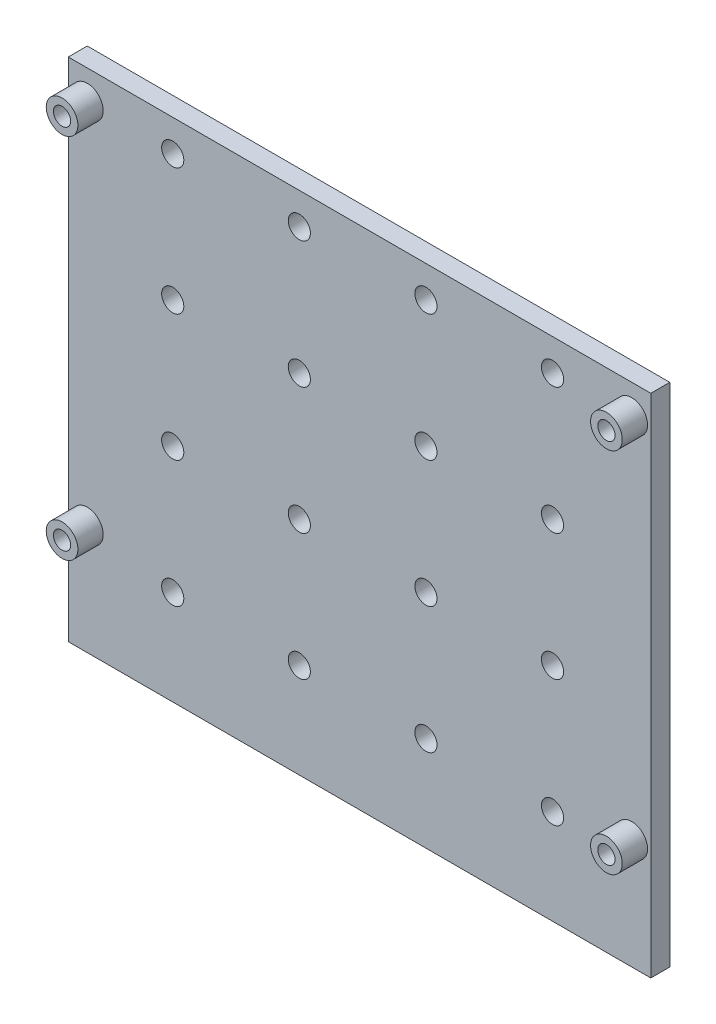
ISO-10303-21;
HEADER;
FILE_DESCRIPTION(('STEP AP214'),'2;1');
FILE_NAME('part.step','',(''),(''),'','','');
FILE_SCHEMA(('AUTOMOTIVE_DESIGN { 1 0 10303 214 1 1 1 1 }'));
ENDSEC;
DATA;
#1=APPLICATION_CONTEXT('core data for automotive mechanical design processes');
#2=APPLICATION_PROTOCOL_DEFINITION('international standard','automotive_design',2000,#1);
#3=PRODUCT_CONTEXT('',#1,'mechanical');
#4=PRODUCT('Part','Part','',(#3));
#5=PRODUCT_RELATED_PRODUCT_CATEGORY('part','',(#4));
#6=PRODUCT_DEFINITION_FORMATION('','',#4);
#7=PRODUCT_DEFINITION_CONTEXT('part definition',#1,'design');
#8=PRODUCT_DEFINITION('design','',#6,#7);
#9=PRODUCT_DEFINITION_SHAPE('','',#8);
#10=(LENGTH_UNIT() NAMED_UNIT(*) SI_UNIT(.MILLI.,.METRE.));
#11=(NAMED_UNIT(*) PLANE_ANGLE_UNIT() SI_UNIT($,.RADIAN.));
#12=(NAMED_UNIT(*) SI_UNIT($,.STERADIAN.) SOLID_ANGLE_UNIT());
#13=UNCERTAINTY_MEASURE_WITH_UNIT(LENGTH_MEASURE(1.E-05),#10,'distance_accuracy_value','');
#14=(GEOMETRIC_REPRESENTATION_CONTEXT(3) GLOBAL_UNCERTAINTY_ASSIGNED_CONTEXT((#13)) GLOBAL_UNIT_ASSIGNED_CONTEXT((#10,
#11,#12)) REPRESENTATION_CONTEXT('',''));
#15=CARTESIAN_POINT('',(0.,0.,0.));
#16=DIRECTION('',(0.,0.,1.));
#17=DIRECTION('',(1.,0.,0.));
#18=AXIS2_PLACEMENT_3D('',#15,#16,#17);
#19=CARTESIAN_POINT('',(0.,0.,3.));
#20=DIRECTION('',(0.,0.,-1.));
#21=DIRECTION('',(-1.,0.,0.));
#22=AXIS2_PLACEMENT_3D('',#19,#20,#21);
#23=PLANE('',#22);
#24=CARTESIAN_POINT('',(30.4875186568319,-25.,3.));
#25=DIRECTION('',(0.,0.,-1.));
#26=DIRECTION('',(-1.,0.,0.));
#27=AXIS2_PLACEMENT_3D('',#24,#25,#26);
#28=CIRCLE('',#27,1.75);
#29=CARTESIAN_POINT('',(28.7375186568319,-25.,3.));
#30=VERTEX_POINT('',#29);
#31=EDGE_CURVE('E380',#30,#30,#28,.T.);
#32=ORIENTED_EDGE('',*,*,#31,.T.);
#33=EDGE_LOOP('',(#32));
#34=FACE_BOUND('',#33,.T.);
#35=CARTESIAN_POINT('',(10.4875186568319,-25.,3.));
#36=DIRECTION('',(0.,0.,-1.));
#37=DIRECTION('',(-1.,0.,0.));
#38=AXIS2_PLACEMENT_3D('',#35,#36,#37);
#39=CIRCLE('',#38,1.75);
#40=CARTESIAN_POINT('',(8.73751865683187,-25.,3.));
#41=VERTEX_POINT('',#40);
#42=EDGE_CURVE('E372',#41,#41,#39,.T.);
#43=ORIENTED_EDGE('',*,*,#42,.T.);
#44=EDGE_LOOP('',(#43));
#45=FACE_BOUND('',#44,.T.);
#46=CARTESIAN_POINT('',(-9.51248134316813,-25.,3.));
#47=DIRECTION('',(0.,0.,-1.));
#48=DIRECTION('',(-1.,0.,0.));
#49=AXIS2_PLACEMENT_3D('',#46,#47,#48);
#50=CIRCLE('',#49,1.75);
#51=CARTESIAN_POINT('',(-11.2624813431681,-25.,3.));
#52=VERTEX_POINT('',#51);
#53=EDGE_CURVE('E364',#52,#52,#50,.T.);
#54=ORIENTED_EDGE('',*,*,#53,.T.);
#55=EDGE_LOOP('',(#54));
#56=FACE_BOUND('',#55,.T.);
#57=CARTESIAN_POINT('',(-29.5124813431681,-25.,3.));
#58=DIRECTION('',(0.,0.,-1.));
#59=DIRECTION('',(-1.,0.,0.));
#60=AXIS2_PLACEMENT_3D('',#57,#58,#59);
#61=CIRCLE('',#60,1.75);
#62=CARTESIAN_POINT('',(-31.2624813431681,-25.,3.));
#63=VERTEX_POINT('',#62);
#64=EDGE_CURVE('E356',#63,#63,#61,.T.);
#65=ORIENTED_EDGE('',*,*,#64,.T.);
#66=EDGE_LOOP('',(#65));
#67=FACE_BOUND('',#66,.T.);
#68=CARTESIAN_POINT('',(30.4875186568319,-5.,3.));
#69=DIRECTION('',(0.,0.,-1.));
#70=DIRECTION('',(-1.,0.,0.));
#71=AXIS2_PLACEMENT_3D('',#68,#69,#70);
#72=CIRCLE('',#71,1.75);
#73=CARTESIAN_POINT('',(28.7375186568319,-5.,3.));
#74=VERTEX_POINT('',#73);
#75=EDGE_CURVE('E348',#74,#74,#72,.T.);
#76=ORIENTED_EDGE('',*,*,#75,.T.);
#77=EDGE_LOOP('',(#76));
#78=FACE_BOUND('',#77,.T.);
#79=CARTESIAN_POINT('',(10.4875186568319,-5.,3.));
#80=DIRECTION('',(0.,0.,-1.));
#81=DIRECTION('',(-1.,0.,0.));
#82=AXIS2_PLACEMENT_3D('',#79,#80,#81);
#83=CIRCLE('',#82,1.75);
#84=CARTESIAN_POINT('',(8.73751865683187,-5.,3.));
#85=VERTEX_POINT('',#84);
#86=EDGE_CURVE('E340',#85,#85,#83,.T.);
#87=ORIENTED_EDGE('',*,*,#86,.T.);
#88=EDGE_LOOP('',(#87));
#89=FACE_BOUND('',#88,.T.);
#90=CARTESIAN_POINT('',(-9.51248134316813,-5.,3.));
#91=DIRECTION('',(0.,0.,-1.));
#92=DIRECTION('',(-1.,0.,0.));
#93=AXIS2_PLACEMENT_3D('',#90,#91,#92);
#94=CIRCLE('',#93,1.75);
#95=CARTESIAN_POINT('',(-11.2624813431681,-5.,3.));
#96=VERTEX_POINT('',#95);
#97=EDGE_CURVE('E332',#96,#96,#94,.T.);
#98=ORIENTED_EDGE('',*,*,#97,.T.);
#99=EDGE_LOOP('',(#98));
#100=FACE_BOUND('',#99,.T.);
#101=CARTESIAN_POINT('',(-29.5124813431681,-5.,3.));
#102=DIRECTION('',(0.,0.,-1.));
#103=DIRECTION('',(-1.,0.,0.));
#104=AXIS2_PLACEMENT_3D('',#101,#102,#103);
#105=CIRCLE('',#104,1.75);
#106=CARTESIAN_POINT('',(-31.2624813431681,-5.,3.));
#107=VERTEX_POINT('',#106);
#108=EDGE_CURVE('E324',#107,#107,#105,.T.);
#109=ORIENTED_EDGE('',*,*,#108,.T.);
#110=EDGE_LOOP('',(#109));
#111=FACE_BOUND('',#110,.T.);
#112=CARTESIAN_POINT('',(30.4875186568319,15.,3.));
#113=DIRECTION('',(0.,0.,-1.));
#114=DIRECTION('',(-1.,0.,0.));
#115=AXIS2_PLACEMENT_3D('',#112,#113,#114);
#116=CIRCLE('',#115,1.75);
#117=CARTESIAN_POINT('',(28.7375186568319,15.,3.));
#118=VERTEX_POINT('',#117);
#119=EDGE_CURVE('E316',#118,#118,#116,.T.);
#120=ORIENTED_EDGE('',*,*,#119,.T.);
#121=EDGE_LOOP('',(#120));
#122=FACE_BOUND('',#121,.T.);
#123=CARTESIAN_POINT('',(10.4875186568319,15.,3.));
#124=DIRECTION('',(0.,0.,-1.));
#125=DIRECTION('',(-1.,0.,0.));
#126=AXIS2_PLACEMENT_3D('',#123,#124,#125);
#127=CIRCLE('',#126,1.75);
#128=CARTESIAN_POINT('',(8.73751865683187,15.,3.));
#129=VERTEX_POINT('',#128);
#130=EDGE_CURVE('E308',#129,#129,#127,.T.);
#131=ORIENTED_EDGE('',*,*,#130,.T.);
#132=EDGE_LOOP('',(#131));
#133=FACE_BOUND('',#132,.T.);
#134=CARTESIAN_POINT('',(-9.51248134316813,15.,3.));
#135=DIRECTION('',(0.,0.,-1.));
#136=DIRECTION('',(-1.,0.,0.));
#137=AXIS2_PLACEMENT_3D('',#134,#135,#136);
#138=CIRCLE('',#137,1.75);
#139=CARTESIAN_POINT('',(-11.2624813431681,15.,3.));
#140=VERTEX_POINT('',#139);
#141=EDGE_CURVE('E300',#140,#140,#138,.T.);
#142=ORIENTED_EDGE('',*,*,#141,.T.);
#143=EDGE_LOOP('',(#142));
#144=FACE_BOUND('',#143,.T.);
#145=CARTESIAN_POINT('',(-29.5124813431681,15.,3.));
#146=DIRECTION('',(0.,0.,-1.));
#147=DIRECTION('',(-1.,0.,0.));
#148=AXIS2_PLACEMENT_3D('',#145,#146,#147);
#149=CIRCLE('',#148,1.75);
#150=CARTESIAN_POINT('',(-31.2624813431681,15.,3.));
#151=VERTEX_POINT('',#150);
#152=EDGE_CURVE('E292',#151,#151,#149,.T.);
#153=ORIENTED_EDGE('',*,*,#152,.T.);
#154=EDGE_LOOP('',(#153));
#155=FACE_BOUND('',#154,.T.);
#156=CARTESIAN_POINT('',(30.4875186568319,35.,3.));
#157=DIRECTION('',(0.,0.,-1.));
#158=DIRECTION('',(-1.,0.,0.));
#159=AXIS2_PLACEMENT_3D('',#156,#157,#158);
#160=CIRCLE('',#159,1.75);
#161=CARTESIAN_POINT('',(28.7375186568319,35.,3.));
#162=VERTEX_POINT('',#161);
#163=EDGE_CURVE('E284',#162,#162,#160,.T.);
#164=ORIENTED_EDGE('',*,*,#163,.T.);
#165=EDGE_LOOP('',(#164));
#166=FACE_BOUND('',#165,.T.);
#167=CARTESIAN_POINT('',(10.4875186568319,35.,3.));
#168=DIRECTION('',(0.,0.,-1.));
#169=DIRECTION('',(-1.,0.,0.));
#170=AXIS2_PLACEMENT_3D('',#167,#168,#169);
#171=CIRCLE('',#170,1.75);
#172=CARTESIAN_POINT('',(8.73751865683187,35.,3.));
#173=VERTEX_POINT('',#172);
#174=EDGE_CURVE('E276',#173,#173,#171,.T.);
#175=ORIENTED_EDGE('',*,*,#174,.T.);
#176=EDGE_LOOP('',(#175));
#177=FACE_BOUND('',#176,.T.);
#178=CARTESIAN_POINT('',(-9.51248134316813,35.,3.));
#179=DIRECTION('',(0.,0.,-1.));
#180=DIRECTION('',(-1.,0.,0.));
#181=AXIS2_PLACEMENT_3D('',#178,#179,#180);
#182=CIRCLE('',#181,1.75);
#183=CARTESIAN_POINT('',(-11.2624813431681,35.,3.));
#184=VERTEX_POINT('',#183);
#185=EDGE_CURVE('E268',#184,#184,#182,.T.);
#186=ORIENTED_EDGE('',*,*,#185,.T.);
#187=EDGE_LOOP('',(#186));
#188=FACE_BOUND('',#187,.T.);
#189=CARTESIAN_POINT('',(-29.5124813431681,35.,3.));
#190=DIRECTION('',(0.,0.,-1.));
#191=DIRECTION('',(-1.,0.,0.));
#192=AXIS2_PLACEMENT_3D('',#189,#190,#191);
#193=CIRCLE('',#192,1.75);
#194=CARTESIAN_POINT('',(-31.2624813431681,35.,3.));
#195=VERTEX_POINT('',#194);
#196=EDGE_CURVE('E260',#195,#195,#193,.T.);
#197=ORIENTED_EDGE('',*,*,#196,.T.);
#198=EDGE_LOOP('',(#197));
#199=FACE_BOUND('',#198,.T.);
#200=CARTESIAN_POINT('',(43.0024813431681,35.4,3.));
#201=DIRECTION('',(0.,0.,-1.));
#202=DIRECTION('',(-1.,0.,0.));
#203=AXIS2_PLACEMENT_3D('',#200,#201,#202);
#204=CIRCLE('',#203,2.5);
#205=CARTESIAN_POINT('',(40.5024813431681,35.4,3.));
#206=VERTEX_POINT('',#205);
#207=EDGE_CURVE('E53',#206,#206,#204,.F.);
#208=ORIENTED_EDGE('',*,*,#207,.F.);
#209=EDGE_LOOP('',(#208));
#210=FACE_BOUND('',#209,.T.);
#211=CARTESIAN_POINT('',(-42.9975186568319,35.4,3.));
#212=DIRECTION('',(0.,0.,-1.));
#213=DIRECTION('',(-1.,0.,0.));
#214=AXIS2_PLACEMENT_3D('',#211,#212,#213);
#215=CIRCLE('',#214,2.5);
#216=CARTESIAN_POINT('',(-45.4975186568319,35.4,3.));
#217=VERTEX_POINT('',#216);
#218=EDGE_CURVE('E133',#217,#217,#215,.F.);
#219=ORIENTED_EDGE('',*,*,#218,.F.);
#220=EDGE_LOOP('',(#219));
#221=FACE_BOUND('',#220,.T.);
#222=DIRECTION('',(0.,1.,0.));
#223=VECTOR('',#222,1.);
#224=CARTESIAN_POINT('',(46.0124813431681,-40.,3.));
#225=LINE('',#224,#223);
#226=CARTESIAN_POINT('',(46.0124813431681,-40.,3.));
#227=VERTEX_POINT('',#226);
#228=CARTESIAN_POINT('',(46.0124813431681,40.,3.));
#229=VERTEX_POINT('',#228);
#230=EDGE_CURVE('E97',#227,#229,#225,.T.);
#231=ORIENTED_EDGE('',*,*,#230,.T.);
#232=DIRECTION('',(-1.,0.,0.));
#233=VECTOR('',#232,1.);
#234=CARTESIAN_POINT('',(-46.0124813431681,40.,3.));
#235=LINE('',#234,#233);
#236=CARTESIAN_POINT('',(-46.0124813431681,40.,3.));
#237=VERTEX_POINT('',#236);
#238=EDGE_CURVE('E92',#229,#237,#235,.T.);
#239=ORIENTED_EDGE('',*,*,#238,.T.);
#240=DIRECTION('',(0.,-1.,0.));
#241=VECTOR('',#240,1.);
#242=CARTESIAN_POINT('',(-46.0124813431681,-40.,3.));
#243=LINE('',#242,#241);
#244=CARTESIAN_POINT('',(-46.0124813431681,-40.,3.));
#245=VERTEX_POINT('',#244);
#246=EDGE_CURVE('E95',#237,#245,#243,.T.);
#247=ORIENTED_EDGE('',*,*,#246,.T.);
#248=DIRECTION('',(1.,0.,0.));
#249=VECTOR('',#248,1.);
#250=CARTESIAN_POINT('',(-46.0124813431681,-40.,3.));
#251=LINE('',#250,#249);
#252=EDGE_CURVE('E61',#245,#227,#251,.T.);
#253=ORIENTED_EDGE('',*,*,#252,.T.);
#254=EDGE_LOOP('',(#231,#239,#247,#253));
#255=FACE_BOUND('',#254,.T.);
#256=CARTESIAN_POINT('',(-42.9975186568319,-22.6,3.));
#257=DIRECTION('',(0.,0.,-1.));
#258=DIRECTION('',(-1.,0.,0.));
#259=AXIS2_PLACEMENT_3D('',#256,#257,#258);
#260=CIRCLE('',#259,2.5);
#261=CARTESIAN_POINT('',(-45.4975186568319,-22.6,3.));
#262=VERTEX_POINT('',#261);
#263=EDGE_CURVE('E137',#262,#262,#260,.F.);
#264=ORIENTED_EDGE('',*,*,#263,.F.);
#265=EDGE_LOOP('',(#264));
#266=FACE_BOUND('',#265,.T.);
#267=CARTESIAN_POINT('',(43.0024813431681,-22.6,3.));
#268=DIRECTION('',(0.,0.,-1.));
#269=DIRECTION('',(-1.,0.,0.));
#270=AXIS2_PLACEMENT_3D('',#267,#268,#269);
#271=CIRCLE('',#270,2.5);
#272=CARTESIAN_POINT('',(40.5024813431681,-22.6,3.));
#273=VERTEX_POINT('',#272);
#274=EDGE_CURVE('E11',#273,#273,#271,.F.);
#275=ORIENTED_EDGE('',*,*,#274,.F.);
#276=EDGE_LOOP('',(#275));
#277=FACE_BOUND('',#276,.T.);
#278=ADVANCED_FACE('F43',(#34,#45,#56,#67,#78,#89,#100,#111,#122,#133,#144,#155,#166,#177,#188,
#199,#210,#221,#255,#266,#277),#23,.F.);
#279=CARTESIAN_POINT('',(0.,0.,0.));
#280=DIRECTION('',(0.,0.,-1.));
#281=DIRECTION('',(-1.,0.,0.));
#282=AXIS2_PLACEMENT_3D('',#279,#280,#281);
#283=PLANE('',#282);
#284=CARTESIAN_POINT('',(30.4875186568319,-25.,0.));
#285=DIRECTION('',(0.,0.,1.));
#286=DIRECTION('',(1.,0.,0.));
#287=AXIS2_PLACEMENT_3D('',#284,#285,#286);
#288=CIRCLE('',#287,1.75);
#289=CARTESIAN_POINT('',(32.2375186568319,-25.,0.));
#290=VERTEX_POINT('',#289);
#291=EDGE_CURVE('E384',#290,#290,#288,.T.);
#292=ORIENTED_EDGE('',*,*,#291,.T.);
#293=EDGE_LOOP('',(#292));
#294=FACE_BOUND('',#293,.T.);
#295=CARTESIAN_POINT('',(10.4875186568319,-25.,0.));
#296=DIRECTION('',(0.,0.,1.));
#297=DIRECTION('',(1.,0.,0.));
#298=AXIS2_PLACEMENT_3D('',#295,#296,#297);
#299=CIRCLE('',#298,1.75);
#300=CARTESIAN_POINT('',(12.2375186568319,-25.,0.));
#301=VERTEX_POINT('',#300);
#302=EDGE_CURVE('E376',#301,#301,#299,.T.);
#303=ORIENTED_EDGE('',*,*,#302,.T.);
#304=EDGE_LOOP('',(#303));
#305=FACE_BOUND('',#304,.T.);
#306=CARTESIAN_POINT('',(-9.51248134316813,-25.,0.));
#307=DIRECTION('',(0.,0.,1.));
#308=DIRECTION('',(1.,0.,0.));
#309=AXIS2_PLACEMENT_3D('',#306,#307,#308);
#310=CIRCLE('',#309,1.75);
#311=CARTESIAN_POINT('',(-7.76248134316813,-25.,0.));
#312=VERTEX_POINT('',#311);
#313=EDGE_CURVE('E368',#312,#312,#310,.T.);
#314=ORIENTED_EDGE('',*,*,#313,.T.);
#315=EDGE_LOOP('',(#314));
#316=FACE_BOUND('',#315,.T.);
#317=CARTESIAN_POINT('',(-29.5124813431681,-25.,0.));
#318=DIRECTION('',(0.,0.,1.));
#319=DIRECTION('',(1.,0.,0.));
#320=AXIS2_PLACEMENT_3D('',#317,#318,#319);
#321=CIRCLE('',#320,1.75);
#322=CARTESIAN_POINT('',(-27.7624813431681,-25.,0.));
#323=VERTEX_POINT('',#322);
#324=EDGE_CURVE('E360',#323,#323,#321,.T.);
#325=ORIENTED_EDGE('',*,*,#324,.T.);
#326=EDGE_LOOP('',(#325));
#327=FACE_BOUND('',#326,.T.);
#328=CARTESIAN_POINT('',(30.4875186568319,-5.,0.));
#329=DIRECTION('',(0.,0.,1.));
#330=DIRECTION('',(1.,0.,0.));
#331=AXIS2_PLACEMENT_3D('',#328,#329,#330);
#332=CIRCLE('',#331,1.75);
#333=CARTESIAN_POINT('',(32.2375186568319,-5.,0.));
#334=VERTEX_POINT('',#333);
#335=EDGE_CURVE('E352',#334,#334,#332,.T.);
#336=ORIENTED_EDGE('',*,*,#335,.T.);
#337=EDGE_LOOP('',(#336));
#338=FACE_BOUND('',#337,.T.);
#339=CARTESIAN_POINT('',(10.4875186568319,-5.,0.));
#340=DIRECTION('',(0.,0.,1.));
#341=DIRECTION('',(1.,0.,0.));
#342=AXIS2_PLACEMENT_3D('',#339,#340,#341);
#343=CIRCLE('',#342,1.75);
#344=CARTESIAN_POINT('',(12.2375186568319,-5.,0.));
#345=VERTEX_POINT('',#344);
#346=EDGE_CURVE('E344',#345,#345,#343,.T.);
#347=ORIENTED_EDGE('',*,*,#346,.T.);
#348=EDGE_LOOP('',(#347));
#349=FACE_BOUND('',#348,.T.);
#350=CARTESIAN_POINT('',(-9.51248134316813,-5.,0.));
#351=DIRECTION('',(0.,0.,1.));
#352=DIRECTION('',(1.,0.,0.));
#353=AXIS2_PLACEMENT_3D('',#350,#351,#352);
#354=CIRCLE('',#353,1.75);
#355=CARTESIAN_POINT('',(-7.76248134316813,-5.,0.));
#356=VERTEX_POINT('',#355);
#357=EDGE_CURVE('E336',#356,#356,#354,.T.);
#358=ORIENTED_EDGE('',*,*,#357,.T.);
#359=EDGE_LOOP('',(#358));
#360=FACE_BOUND('',#359,.T.);
#361=CARTESIAN_POINT('',(-29.5124813431681,-5.,0.));
#362=DIRECTION('',(0.,0.,1.));
#363=DIRECTION('',(1.,0.,0.));
#364=AXIS2_PLACEMENT_3D('',#361,#362,#363);
#365=CIRCLE('',#364,1.75);
#366=CARTESIAN_POINT('',(-27.7624813431681,-5.,0.));
#367=VERTEX_POINT('',#366);
#368=EDGE_CURVE('E328',#367,#367,#365,.T.);
#369=ORIENTED_EDGE('',*,*,#368,.T.);
#370=EDGE_LOOP('',(#369));
#371=FACE_BOUND('',#370,.T.);
#372=CARTESIAN_POINT('',(30.4875186568319,15.,0.));
#373=DIRECTION('',(0.,0.,1.));
#374=DIRECTION('',(1.,0.,0.));
#375=AXIS2_PLACEMENT_3D('',#372,#373,#374);
#376=CIRCLE('',#375,1.75);
#377=CARTESIAN_POINT('',(32.2375186568319,15.,0.));
#378=VERTEX_POINT('',#377);
#379=EDGE_CURVE('E320',#378,#378,#376,.T.);
#380=ORIENTED_EDGE('',*,*,#379,.T.);
#381=EDGE_LOOP('',(#380));
#382=FACE_BOUND('',#381,.T.);
#383=CARTESIAN_POINT('',(10.4875186568319,15.,0.));
#384=DIRECTION('',(0.,0.,1.));
#385=DIRECTION('',(1.,0.,0.));
#386=AXIS2_PLACEMENT_3D('',#383,#384,#385);
#387=CIRCLE('',#386,1.75);
#388=CARTESIAN_POINT('',(12.2375186568319,15.,0.));
#389=VERTEX_POINT('',#388);
#390=EDGE_CURVE('E312',#389,#389,#387,.T.);
#391=ORIENTED_EDGE('',*,*,#390,.T.);
#392=EDGE_LOOP('',(#391));
#393=FACE_BOUND('',#392,.T.);
#394=CARTESIAN_POINT('',(-9.51248134316813,15.,0.));
#395=DIRECTION('',(0.,0.,1.));
#396=DIRECTION('',(1.,0.,0.));
#397=AXIS2_PLACEMENT_3D('',#394,#395,#396);
#398=CIRCLE('',#397,1.75);
#399=CARTESIAN_POINT('',(-7.76248134316813,15.,0.));
#400=VERTEX_POINT('',#399);
#401=EDGE_CURVE('E304',#400,#400,#398,.T.);
#402=ORIENTED_EDGE('',*,*,#401,.T.);
#403=EDGE_LOOP('',(#402));
#404=FACE_BOUND('',#403,.T.);
#405=CARTESIAN_POINT('',(-29.5124813431681,15.,0.));
#406=DIRECTION('',(0.,0.,1.));
#407=DIRECTION('',(1.,0.,0.));
#408=AXIS2_PLACEMENT_3D('',#405,#406,#407);
#409=CIRCLE('',#408,1.75);
#410=CARTESIAN_POINT('',(-27.7624813431681,15.,0.));
#411=VERTEX_POINT('',#410);
#412=EDGE_CURVE('E296',#411,#411,#409,.T.);
#413=ORIENTED_EDGE('',*,*,#412,.T.);
#414=EDGE_LOOP('',(#413));
#415=FACE_BOUND('',#414,.T.);
#416=CARTESIAN_POINT('',(30.4875186568319,35.,0.));
#417=DIRECTION('',(0.,0.,1.));
#418=DIRECTION('',(1.,0.,0.));
#419=AXIS2_PLACEMENT_3D('',#416,#417,#418);
#420=CIRCLE('',#419,1.75);
#421=CARTESIAN_POINT('',(32.2375186568319,35.,0.));
#422=VERTEX_POINT('',#421);
#423=EDGE_CURVE('E288',#422,#422,#420,.T.);
#424=ORIENTED_EDGE('',*,*,#423,.T.);
#425=EDGE_LOOP('',(#424));
#426=FACE_BOUND('',#425,.T.);
#427=CARTESIAN_POINT('',(10.4875186568319,35.,0.));
#428=DIRECTION('',(0.,0.,1.));
#429=DIRECTION('',(1.,0.,0.));
#430=AXIS2_PLACEMENT_3D('',#427,#428,#429);
#431=CIRCLE('',#430,1.75);
#432=CARTESIAN_POINT('',(12.2375186568319,35.,0.));
#433=VERTEX_POINT('',#432);
#434=EDGE_CURVE('E280',#433,#433,#431,.T.);
#435=ORIENTED_EDGE('',*,*,#434,.T.);
#436=EDGE_LOOP('',(#435));
#437=FACE_BOUND('',#436,.T.);
#438=CARTESIAN_POINT('',(-9.51248134316813,35.,0.));
#439=DIRECTION('',(0.,0.,1.));
#440=DIRECTION('',(1.,0.,0.));
#441=AXIS2_PLACEMENT_3D('',#438,#439,#440);
#442=CIRCLE('',#441,1.75);
#443=CARTESIAN_POINT('',(-7.76248134316813,35.,0.));
#444=VERTEX_POINT('',#443);
#445=EDGE_CURVE('E272',#444,#444,#442,.T.);
#446=ORIENTED_EDGE('',*,*,#445,.T.);
#447=EDGE_LOOP('',(#446));
#448=FACE_BOUND('',#447,.T.);
#449=CARTESIAN_POINT('',(-29.5124813431681,35.,0.));
#450=DIRECTION('',(0.,0.,1.));
#451=DIRECTION('',(1.,0.,0.));
#452=AXIS2_PLACEMENT_3D('',#449,#450,#451);
#453=CIRCLE('',#452,1.75);
#454=CARTESIAN_POINT('',(-27.7624813431681,35.,0.));
#455=VERTEX_POINT('',#454);
#456=EDGE_CURVE('E264',#455,#455,#453,.T.);
#457=ORIENTED_EDGE('',*,*,#456,.T.);
#458=EDGE_LOOP('',(#457));
#459=FACE_BOUND('',#458,.T.);
#460=CARTESIAN_POINT('',(-42.9975186568319,-22.6,0.));
#461=DIRECTION('',(0.,0.,1.));
#462=DIRECTION('',(1.,0.,0.));
#463=AXIS2_PLACEMENT_3D('',#460,#461,#462);
#464=CIRCLE('',#463,1.365);
#465=CARTESIAN_POINT('',(-41.6325186568319,-22.6,0.));
#466=VERTEX_POINT('',#465);
#467=EDGE_CURVE('E211',#466,#466,#464,.T.);
#468=ORIENTED_EDGE('',*,*,#467,.T.);
#469=EDGE_LOOP('',(#468));
#470=FACE_BOUND('',#469,.T.);
#471=CARTESIAN_POINT('',(-42.9975186568319,35.4,0.));
#472=DIRECTION('',(0.,0.,1.));
#473=DIRECTION('',(1.,0.,0.));
#474=AXIS2_PLACEMENT_3D('',#471,#472,#473);
#475=CIRCLE('',#474,1.365);
#476=CARTESIAN_POINT('',(-41.6325186568319,35.4,0.));
#477=VERTEX_POINT('',#476);
#478=EDGE_CURVE('E120',#477,#477,#475,.T.);
#479=ORIENTED_EDGE('',*,*,#478,.T.);
#480=EDGE_LOOP('',(#479));
#481=FACE_BOUND('',#480,.T.);
#482=DIRECTION('',(0.,1.,0.));
#483=VECTOR('',#482,1.);
#484=CARTESIAN_POINT('',(46.0124813431681,-40.,0.));
#485=LINE('',#484,#483);
#486=CARTESIAN_POINT('',(46.0124813431681,-40.,0.));
#487=VERTEX_POINT('',#486);
#488=CARTESIAN_POINT('',(46.0124813431681,40.,0.));
#489=VERTEX_POINT('',#488);
#490=EDGE_CURVE('E116',#487,#489,#485,.T.);
#491=ORIENTED_EDGE('',*,*,#490,.F.);
#492=DIRECTION('',(1.,0.,0.));
#493=VECTOR('',#492,1.);
#494=CARTESIAN_POINT('',(-46.0124813431681,-40.,0.));
#495=LINE('',#494,#493);
#496=CARTESIAN_POINT('',(-46.0124813431681,-40.,0.));
#497=VERTEX_POINT('',#496);
#498=EDGE_CURVE('E84',#497,#487,#495,.T.);
#499=ORIENTED_EDGE('',*,*,#498,.F.);
#500=DIRECTION('',(0.,-1.,0.));
#501=VECTOR('',#500,1.);
#502=CARTESIAN_POINT('',(-46.0124813431681,-40.,0.));
#503=LINE('',#502,#501);
#504=CARTESIAN_POINT('',(-46.0124813431681,40.,0.));
#505=VERTEX_POINT('',#504);
#506=EDGE_CURVE('E78',#505,#497,#503,.T.);
#507=ORIENTED_EDGE('',*,*,#506,.F.);
#508=DIRECTION('',(-1.,0.,0.));
#509=VECTOR('',#508,1.);
#510=CARTESIAN_POINT('',(-46.0124813431681,40.,0.));
#511=LINE('',#510,#509);
#512=EDGE_CURVE('E103',#489,#505,#511,.T.);
#513=ORIENTED_EDGE('',*,*,#512,.F.);
#514=EDGE_LOOP('',(#491,#499,#507,#513));
#515=FACE_BOUND('',#514,.T.);
#516=CARTESIAN_POINT('',(43.0024813431681,35.4,0.));
#517=DIRECTION('',(0.,0.,1.));
#518=DIRECTION('',(1.,0.,0.));
#519=AXIS2_PLACEMENT_3D('',#516,#517,#518);
#520=CIRCLE('',#519,1.365);
#521=CARTESIAN_POINT('',(44.3674813431681,35.4,0.));
#522=VERTEX_POINT('',#521);
#523=EDGE_CURVE('E206',#522,#522,#520,.T.);
#524=ORIENTED_EDGE('',*,*,#523,.T.);
#525=EDGE_LOOP('',(#524));
#526=FACE_BOUND('',#525,.T.);
#527=CARTESIAN_POINT('',(43.0024813431681,-22.6,0.));
#528=DIRECTION('',(0.,0.,1.));
#529=DIRECTION('',(1.,0.,0.));
#530=AXIS2_PLACEMENT_3D('',#527,#528,#529);
#531=CIRCLE('',#530,1.365);
#532=CARTESIAN_POINT('',(44.3674813431681,-22.6,0.));
#533=VERTEX_POINT('',#532);
#534=EDGE_CURVE('E209',#533,#533,#531,.T.);
#535=ORIENTED_EDGE('',*,*,#534,.T.);
#536=EDGE_LOOP('',(#535));
#537=FACE_BOUND('',#536,.T.);
#538=ADVANCED_FACE('F148',(#294,#305,#316,#327,#338,#349,#360,#371,#382,#393,#404,#415,#426,
#437,#448,#459,#470,#481,#515,#526,#537),#283,.T.);
#539=CARTESIAN_POINT('',(46.0124813431681,-40.,3.));
#540=DIRECTION('',(-1.,0.,0.));
#541=DIRECTION('',(0.,0.,1.));
#542=AXIS2_PLACEMENT_3D('',#539,#540,#541);
#543=PLANE('',#542);
#544=ORIENTED_EDGE('',*,*,#490,.T.);
#545=DIRECTION('',(0.,0.,-1.));
#546=VECTOR('',#545,1.);
#547=CARTESIAN_POINT('',(46.0124813431681,40.,3.));
#548=LINE('',#547,#546);
#549=EDGE_CURVE('E105',#229,#489,#548,.T.);
#550=ORIENTED_EDGE('',*,*,#549,.F.);
#551=ORIENTED_EDGE('',*,*,#230,.F.);
#552=DIRECTION('',(0.,0.,-1.));
#553=VECTOR('',#552,1.);
#554=CARTESIAN_POINT('',(46.0124813431681,-40.,3.));
#555=LINE('',#554,#553);
#556=EDGE_CURVE('E112',#227,#487,#555,.T.);
#557=ORIENTED_EDGE('',*,*,#556,.T.);
#558=EDGE_LOOP('',(#544,#550,#551,#557));
#559=FACE_BOUND('',#558,.T.);
#560=ADVANCED_FACE('F45',(#559),#543,.F.);
#561=CARTESIAN_POINT('',(-46.0124813431681,40.,3.));
#562=DIRECTION('',(0.,-1.,0.));
#563=DIRECTION('',(0.,0.,-1.));
#564=AXIS2_PLACEMENT_3D('',#561,#562,#563);
#565=PLANE('',#564);
#566=ORIENTED_EDGE('',*,*,#512,.T.);
#567=DIRECTION('',(0.,0.,-1.));
#568=VECTOR('',#567,1.);
#569=CARTESIAN_POINT('',(-46.0124813431681,40.,3.));
#570=LINE('',#569,#568);
#571=EDGE_CURVE('E101',#237,#505,#570,.T.);
#572=ORIENTED_EDGE('',*,*,#571,.F.);
#573=ORIENTED_EDGE('',*,*,#238,.F.);
#574=ORIENTED_EDGE('',*,*,#549,.T.);
#575=EDGE_LOOP('',(#566,#572,#573,#574));
#576=FACE_BOUND('',#575,.T.);
#577=ADVANCED_FACE('F102',(#576),#565,.F.);
#578=CARTESIAN_POINT('',(-46.0124813431681,-40.,3.));
#579=DIRECTION('',(1.,0.,0.));
#580=DIRECTION('',(0.,0.,-1.));
#581=AXIS2_PLACEMENT_3D('',#578,#579,#580);
#582=PLANE('',#581);
#583=ORIENTED_EDGE('',*,*,#506,.T.);
#584=DIRECTION('',(0.,0.,-1.));
#585=VECTOR('',#584,1.);
#586=CARTESIAN_POINT('',(-46.0124813431681,-40.,3.));
#587=LINE('',#586,#585);
#588=EDGE_CURVE('E106',#245,#497,#587,.T.);
#589=ORIENTED_EDGE('',*,*,#588,.F.);
#590=ORIENTED_EDGE('',*,*,#246,.F.);
#591=ORIENTED_EDGE('',*,*,#571,.T.);
#592=EDGE_LOOP('',(#583,#589,#590,#591));
#593=FACE_BOUND('',#592,.T.);
#594=ADVANCED_FACE('F108',(#593),#582,.F.);
#595=CARTESIAN_POINT('',(-46.0124813431681,-40.,3.));
#596=DIRECTION('',(0.,1.,0.));
#597=DIRECTION('',(0.,0.,1.));
#598=AXIS2_PLACEMENT_3D('',#595,#596,#597);
#599=PLANE('',#598);
#600=ORIENTED_EDGE('',*,*,#498,.T.);
#601=ORIENTED_EDGE('',*,*,#556,.F.);
#602=ORIENTED_EDGE('',*,*,#252,.F.);
#603=ORIENTED_EDGE('',*,*,#588,.T.);
#604=EDGE_LOOP('',(#600,#601,#602,#603));
#605=FACE_BOUND('',#604,.T.);
#606=ADVANCED_FACE('F184',(#605),#599,.F.);
#607=CARTESIAN_POINT('',(-42.9975186568319,35.4,3.));
#608=DIRECTION('',(0.,0.,-1.));
#609=DIRECTION('',(-1.,0.,0.));
#610=AXIS2_PLACEMENT_3D('',#607,#608,#609);
#611=CYLINDRICAL_SURFACE('',#610,1.365);
#612=ORIENTED_EDGE('',*,*,#478,.F.);
#613=EDGE_LOOP('',(#612));
#614=FACE_BOUND('',#613,.T.);
#615=CARTESIAN_POINT('',(-42.9975186568319,35.4,7.));
#616=DIRECTION('',(0.,0.,1.));
#617=DIRECTION('',(1.,0.,0.));
#618=AXIS2_PLACEMENT_3D('',#615,#616,#617);
#619=CIRCLE('',#618,1.365);
#620=CARTESIAN_POINT('',(-41.6325186568319,35.4,7.));
#621=VERTEX_POINT('',#620);
#622=EDGE_CURVE('E219',#621,#621,#619,.T.);
#623=ORIENTED_EDGE('',*,*,#622,.T.);
#624=EDGE_LOOP('',(#623));
#625=FACE_BOUND('',#624,.T.);
#626=ADVANCED_FACE('F181',(#614,#625),#611,.F.);
#627=CARTESIAN_POINT('',(43.0024813431681,35.4,3.));
#628=DIRECTION('',(0.,0.,-1.));
#629=DIRECTION('',(-1.,0.,0.));
#630=AXIS2_PLACEMENT_3D('',#627,#628,#629);
#631=CYLINDRICAL_SURFACE('',#630,1.365);
#632=ORIENTED_EDGE('',*,*,#523,.F.);
#633=EDGE_LOOP('',(#632));
#634=FACE_BOUND('',#633,.T.);
#635=CARTESIAN_POINT('',(43.0024813431681,35.4,7.));
#636=DIRECTION('',(0.,0.,1.));
#637=DIRECTION('',(1.,0.,0.));
#638=AXIS2_PLACEMENT_3D('',#635,#636,#637);
#639=CIRCLE('',#638,1.365);
#640=CARTESIAN_POINT('',(44.3674813431681,35.4,7.));
#641=VERTEX_POINT('',#640);
#642=EDGE_CURVE('E244',#641,#641,#639,.T.);
#643=ORIENTED_EDGE('',*,*,#642,.T.);
#644=EDGE_LOOP('',(#643));
#645=FACE_BOUND('',#644,.T.);
#646=ADVANCED_FACE('F177',(#634,#645),#631,.F.);
#647=CARTESIAN_POINT('',(-42.9975186568319,-22.6,3.));
#648=DIRECTION('',(0.,0.,-1.));
#649=DIRECTION('',(-1.,0.,0.));
#650=AXIS2_PLACEMENT_3D('',#647,#648,#649);
#651=CYLINDRICAL_SURFACE('',#650,1.365);
#652=ORIENTED_EDGE('',*,*,#467,.F.);
#653=EDGE_LOOP('',(#652));
#654=FACE_BOUND('',#653,.T.);
#655=CARTESIAN_POINT('',(-42.9975186568319,-22.6,7.));
#656=DIRECTION('',(0.,0.,1.));
#657=DIRECTION('',(1.,0.,0.));
#658=AXIS2_PLACEMENT_3D('',#655,#656,#657);
#659=CIRCLE('',#658,1.365);
#660=CARTESIAN_POINT('',(-41.6325186568319,-22.6,7.));
#661=VERTEX_POINT('',#660);
#662=EDGE_CURVE('E235',#661,#661,#659,.T.);
#663=ORIENTED_EDGE('',*,*,#662,.T.);
#664=EDGE_LOOP('',(#663));
#665=FACE_BOUND('',#664,.T.);
#666=ADVANCED_FACE('F173',(#654,#665),#651,.F.);
#667=CARTESIAN_POINT('',(43.0024813431681,-22.6,3.));
#668=DIRECTION('',(0.,0.,-1.));
#669=DIRECTION('',(-1.,0.,0.));
#670=AXIS2_PLACEMENT_3D('',#667,#668,#669);
#671=CYLINDRICAL_SURFACE('',#670,1.365);
#672=ORIENTED_EDGE('',*,*,#534,.F.);
#673=EDGE_LOOP('',(#672));
#674=FACE_BOUND('',#673,.T.);
#675=CARTESIAN_POINT('',(43.0024813431681,-22.6,7.));
#676=DIRECTION('',(0.,0.,1.));
#677=DIRECTION('',(1.,0.,0.));
#678=AXIS2_PLACEMENT_3D('',#675,#676,#677);
#679=CIRCLE('',#678,1.365);
#680=CARTESIAN_POINT('',(44.3674813431681,-22.6,7.));
#681=VERTEX_POINT('',#680);
#682=EDGE_CURVE('E252',#681,#681,#679,.T.);
#683=ORIENTED_EDGE('',*,*,#682,.T.);
#684=EDGE_LOOP('',(#683));
#685=FACE_BOUND('',#684,.T.);
#686=ADVANCED_FACE('F166',(#674,#685),#671,.F.);
#687=CARTESIAN_POINT('',(-42.9975186568319,35.4,7.));
#688=DIRECTION('',(0.,0.,1.));
#689=DIRECTION('',(1.,0.,0.));
#690=AXIS2_PLACEMENT_3D('',#687,#688,#689);
#691=PLANE('',#690);
#692=CARTESIAN_POINT('',(-42.9975186568319,35.4,7.));
#693=DIRECTION('',(0.,0.,1.));
#694=DIRECTION('',(1.,0.,0.));
#695=AXIS2_PLACEMENT_3D('',#692,#693,#694);
#696=CIRCLE('',#695,2.5);
#697=CARTESIAN_POINT('',(-40.4975186568319,35.4,7.));
#698=VERTEX_POINT('',#697);
#699=EDGE_CURVE('E212',#698,#698,#696,.T.);
#700=ORIENTED_EDGE('',*,*,#699,.T.);
#701=EDGE_LOOP('',(#700));
#702=FACE_BOUND('',#701,.T.);
#703=ORIENTED_EDGE('',*,*,#622,.F.);
#704=EDGE_LOOP('',(#703));
#705=FACE_BOUND('',#704,.T.);
#706=ADVANCED_FACE('F156',(#702,#705),#691,.T.);
#707=CARTESIAN_POINT('',(-42.9975186568319,35.4,7.));
#708=DIRECTION('',(0.,0.,-1.));
#709=DIRECTION('',(-1.,0.,0.));
#710=AXIS2_PLACEMENT_3D('',#707,#708,#709);
#711=CYLINDRICAL_SURFACE('',#710,2.5);
#712=ORIENTED_EDGE('',*,*,#699,.F.);
#713=EDGE_LOOP('',(#712));
#714=FACE_BOUND('',#713,.T.);
#715=ORIENTED_EDGE('',*,*,#218,.T.);
#716=EDGE_LOOP('',(#715));
#717=FACE_BOUND('',#716,.T.);
#718=ADVANCED_FACE('F153',(#714,#717),#711,.T.);
#719=CARTESIAN_POINT('',(-42.9975186568319,-22.6,7.));
#720=DIRECTION('',(0.,0.,1.));
#721=DIRECTION('',(1.,0.,0.));
#722=AXIS2_PLACEMENT_3D('',#719,#720,#721);
#723=PLANE('',#722);
#724=CARTESIAN_POINT('',(-42.9975186568319,-22.6,7.));
#725=DIRECTION('',(0.,0.,1.));
#726=DIRECTION('',(1.,0.,0.));
#727=AXIS2_PLACEMENT_3D('',#724,#725,#726);
#728=CIRCLE('',#727,2.5);
#729=CARTESIAN_POINT('',(-40.4975186568319,-22.6,7.));
#730=VERTEX_POINT('',#729);
#731=EDGE_CURVE('E238',#730,#730,#728,.T.);
#732=ORIENTED_EDGE('',*,*,#731,.T.);
#733=EDGE_LOOP('',(#732));
#734=FACE_BOUND('',#733,.T.);
#735=ORIENTED_EDGE('',*,*,#662,.F.);
#736=EDGE_LOOP('',(#735));
#737=FACE_BOUND('',#736,.T.);
#738=ADVANCED_FACE('F155',(#734,#737),#723,.T.);
#739=CARTESIAN_POINT('',(-42.9975186568319,-22.6,7.));
#740=DIRECTION('',(0.,0.,-1.));
#741=DIRECTION('',(-1.,0.,0.));
#742=AXIS2_PLACEMENT_3D('',#739,#740,#741);
#743=CYLINDRICAL_SURFACE('',#742,2.5);
#744=ORIENTED_EDGE('',*,*,#731,.F.);
#745=EDGE_LOOP('',(#744));
#746=FACE_BOUND('',#745,.T.);
#747=ORIENTED_EDGE('',*,*,#263,.T.);
#748=EDGE_LOOP('',(#747));
#749=FACE_BOUND('',#748,.T.);
#750=ADVANCED_FACE('F163',(#746,#749),#743,.T.);
#751=CARTESIAN_POINT('',(43.0024813431681,35.4,7.));
#752=DIRECTION('',(0.,0.,1.));
#753=DIRECTION('',(1.,0.,0.));
#754=AXIS2_PLACEMENT_3D('',#751,#752,#753);
#755=PLANE('',#754);
#756=CARTESIAN_POINT('',(43.0024813431681,35.4,7.));
#757=DIRECTION('',(0.,0.,1.));
#758=DIRECTION('',(1.,0.,0.));
#759=AXIS2_PLACEMENT_3D('',#756,#757,#758);
#760=CIRCLE('',#759,2.5);
#761=CARTESIAN_POINT('',(45.5024813431681,35.4,7.));
#762=VERTEX_POINT('',#761);
#763=EDGE_CURVE('E248',#762,#762,#760,.T.);
#764=ORIENTED_EDGE('',*,*,#763,.T.);
#765=EDGE_LOOP('',(#764));
#766=FACE_BOUND('',#765,.T.);
#767=ORIENTED_EDGE('',*,*,#642,.F.);
#768=EDGE_LOOP('',(#767));
#769=FACE_BOUND('',#768,.T.);
#770=ADVANCED_FACE('F451',(#766,#769),#755,.T.);
#771=CARTESIAN_POINT('',(43.0024813431681,35.4,7.));
#772=DIRECTION('',(0.,0.,-1.));
#773=DIRECTION('',(-1.,0.,0.));
#774=AXIS2_PLACEMENT_3D('',#771,#772,#773);
#775=CYLINDRICAL_SURFACE('',#774,2.5);
#776=ORIENTED_EDGE('',*,*,#763,.F.);
#777=EDGE_LOOP('',(#776));
#778=FACE_BOUND('',#777,.T.);
#779=ORIENTED_EDGE('',*,*,#207,.T.);
#780=EDGE_LOOP('',(#779));
#781=FACE_BOUND('',#780,.T.);
#782=ADVANCED_FACE('F144',(#778,#781),#775,.T.);
#783=CARTESIAN_POINT('',(43.0024813431681,-22.6,7.));
#784=DIRECTION('',(0.,0.,1.));
#785=DIRECTION('',(1.,0.,0.));
#786=AXIS2_PLACEMENT_3D('',#783,#784,#785);
#787=PLANE('',#786);
#788=CARTESIAN_POINT('',(43.0024813431681,-22.6,7.));
#789=DIRECTION('',(0.,0.,1.));
#790=DIRECTION('',(1.,0.,0.));
#791=AXIS2_PLACEMENT_3D('',#788,#789,#790);
#792=CIRCLE('',#791,2.5);
#793=CARTESIAN_POINT('',(45.5024813431681,-22.6,7.));
#794=VERTEX_POINT('',#793);
#795=EDGE_CURVE('E256',#794,#794,#792,.T.);
#796=ORIENTED_EDGE('',*,*,#795,.T.);
#797=EDGE_LOOP('',(#796));
#798=FACE_BOUND('',#797,.T.);
#799=ORIENTED_EDGE('',*,*,#682,.F.);
#800=EDGE_LOOP('',(#799));
#801=FACE_BOUND('',#800,.T.);
#802=ADVANCED_FACE('F440',(#798,#801),#787,.T.);
#803=CARTESIAN_POINT('',(43.0024813431681,-22.6,7.));
#804=DIRECTION('',(0.,0.,-1.));
#805=DIRECTION('',(-1.,0.,0.));
#806=AXIS2_PLACEMENT_3D('',#803,#804,#805);
#807=CYLINDRICAL_SURFACE('',#806,2.5);
#808=ORIENTED_EDGE('',*,*,#795,.F.);
#809=EDGE_LOOP('',(#808));
#810=FACE_BOUND('',#809,.T.);
#811=ORIENTED_EDGE('',*,*,#274,.T.);
#812=EDGE_LOOP('',(#811));
#813=FACE_BOUND('',#812,.T.);
#814=ADVANCED_FACE('F430',(#810,#813),#807,.T.);
#815=CARTESIAN_POINT('',(-29.5124813431681,35.,0.));
#816=DIRECTION('',(0.,0.,1.));
#817=DIRECTION('',(1.,0.,0.));
#818=AXIS2_PLACEMENT_3D('',#815,#816,#817);
#819=CYLINDRICAL_SURFACE('',#818,1.75);
#820=ORIENTED_EDGE('',*,*,#456,.F.);
#821=EDGE_LOOP('',(#820));
#822=FACE_BOUND('',#821,.T.);
#823=ORIENTED_EDGE('',*,*,#196,.F.);
#824=EDGE_LOOP('',(#823));
#825=FACE_BOUND('',#824,.T.);
#826=ADVANCED_FACE('F427',(#822,#825),#819,.F.);
#827=CARTESIAN_POINT('',(-9.51248134316813,35.,0.));
#828=DIRECTION('',(0.,0.,1.));
#829=DIRECTION('',(1.,0.,0.));
#830=AXIS2_PLACEMENT_3D('',#827,#828,#829);
#831=CYLINDRICAL_SURFACE('',#830,1.75);
#832=ORIENTED_EDGE('',*,*,#445,.F.);
#833=EDGE_LOOP('',(#832));
#834=FACE_BOUND('',#833,.T.);
#835=ORIENTED_EDGE('',*,*,#185,.F.);
#836=EDGE_LOOP('',(#835));
#837=FACE_BOUND('',#836,.T.);
#838=ADVANCED_FACE('F429',(#834,#837),#831,.F.);
#839=CARTESIAN_POINT('',(10.4875186568319,35.,0.));
#840=DIRECTION('',(0.,0.,1.));
#841=DIRECTION('',(1.,0.,0.));
#842=AXIS2_PLACEMENT_3D('',#839,#840,#841);
#843=CYLINDRICAL_SURFACE('',#842,1.75);
#844=ORIENTED_EDGE('',*,*,#434,.F.);
#845=EDGE_LOOP('',(#844));
#846=FACE_BOUND('',#845,.T.);
#847=ORIENTED_EDGE('',*,*,#174,.F.);
#848=EDGE_LOOP('',(#847));
#849=FACE_BOUND('',#848,.T.);
#850=ADVANCED_FACE('F437',(#846,#849),#843,.F.);
#851=CARTESIAN_POINT('',(30.4875186568319,35.,0.));
#852=DIRECTION('',(0.,0.,1.));
#853=DIRECTION('',(1.,0.,0.));
#854=AXIS2_PLACEMENT_3D('',#851,#852,#853);
#855=CYLINDRICAL_SURFACE('',#854,1.75);
#856=ORIENTED_EDGE('',*,*,#423,.F.);
#857=EDGE_LOOP('',(#856));
#858=FACE_BOUND('',#857,.T.);
#859=ORIENTED_EDGE('',*,*,#163,.F.);
#860=EDGE_LOOP('',(#859));
#861=FACE_BOUND('',#860,.T.);
#862=ADVANCED_FACE('F526',(#858,#861),#855,.F.);
#863=CARTESIAN_POINT('',(-29.5124813431681,15.,0.));
#864=DIRECTION('',(0.,0.,1.));
#865=DIRECTION('',(1.,0.,0.));
#866=AXIS2_PLACEMENT_3D('',#863,#864,#865);
#867=CYLINDRICAL_SURFACE('',#866,1.75);
#868=ORIENTED_EDGE('',*,*,#412,.F.);
#869=EDGE_LOOP('',(#868));
#870=FACE_BOUND('',#869,.T.);
#871=ORIENTED_EDGE('',*,*,#152,.F.);
#872=EDGE_LOOP('',(#871));
#873=FACE_BOUND('',#872,.T.);
#874=ADVANCED_FACE('F536',(#870,#873),#867,.F.);
#875=CARTESIAN_POINT('',(-9.51248134316813,15.,0.));
#876=DIRECTION('',(0.,0.,1.));
#877=DIRECTION('',(1.,0.,0.));
#878=AXIS2_PLACEMENT_3D('',#875,#876,#877);
#879=CYLINDRICAL_SURFACE('',#878,1.75);
#880=ORIENTED_EDGE('',*,*,#401,.F.);
#881=EDGE_LOOP('',(#880));
#882=FACE_BOUND('',#881,.T.);
#883=ORIENTED_EDGE('',*,*,#141,.F.);
#884=EDGE_LOOP('',(#883));
#885=FACE_BOUND('',#884,.T.);
#886=ADVANCED_FACE('F547',(#882,#885),#879,.F.);
#887=CARTESIAN_POINT('',(10.4875186568319,15.,0.));
#888=DIRECTION('',(0.,0.,1.));
#889=DIRECTION('',(1.,0.,0.));
#890=AXIS2_PLACEMENT_3D('',#887,#888,#889);
#891=CYLINDRICAL_SURFACE('',#890,1.75);
#892=ORIENTED_EDGE('',*,*,#390,.F.);
#893=EDGE_LOOP('',(#892));
#894=FACE_BOUND('',#893,.T.);
#895=ORIENTED_EDGE('',*,*,#130,.F.);
#896=EDGE_LOOP('',(#895));
#897=FACE_BOUND('',#896,.T.);
#898=ADVANCED_FACE('F558',(#894,#897),#891,.F.);
#899=CARTESIAN_POINT('',(30.4875186568319,15.,0.));
#900=DIRECTION('',(0.,0.,1.));
#901=DIRECTION('',(1.,0.,0.));
#902=AXIS2_PLACEMENT_3D('',#899,#900,#901);
#903=CYLINDRICAL_SURFACE('',#902,1.75);
#904=ORIENTED_EDGE('',*,*,#379,.F.);
#905=EDGE_LOOP('',(#904));
#906=FACE_BOUND('',#905,.T.);
#907=ORIENTED_EDGE('',*,*,#119,.F.);
#908=EDGE_LOOP('',(#907));
#909=FACE_BOUND('',#908,.T.);
#910=ADVANCED_FACE('F569',(#906,#909),#903,.F.);
#911=CARTESIAN_POINT('',(-29.5124813431681,-5.,0.));
#912=DIRECTION('',(0.,0.,1.));
#913=DIRECTION('',(1.,0.,0.));
#914=AXIS2_PLACEMENT_3D('',#911,#912,#913);
#915=CYLINDRICAL_SURFACE('',#914,1.75);
#916=ORIENTED_EDGE('',*,*,#368,.F.);
#917=EDGE_LOOP('',(#916));
#918=FACE_BOUND('',#917,.T.);
#919=ORIENTED_EDGE('',*,*,#108,.F.);
#920=EDGE_LOOP('',(#919));
#921=FACE_BOUND('',#920,.T.);
#922=ADVANCED_FACE('F580',(#918,#921),#915,.F.);
#923=CARTESIAN_POINT('',(-9.51248134316813,-5.,0.));
#924=DIRECTION('',(0.,0.,1.));
#925=DIRECTION('',(1.,0.,0.));
#926=AXIS2_PLACEMENT_3D('',#923,#924,#925);
#927=CYLINDRICAL_SURFACE('',#926,1.75);
#928=ORIENTED_EDGE('',*,*,#357,.F.);
#929=EDGE_LOOP('',(#928));
#930=FACE_BOUND('',#929,.T.);
#931=ORIENTED_EDGE('',*,*,#97,.F.);
#932=EDGE_LOOP('',(#931));
#933=FACE_BOUND('',#932,.T.);
#934=ADVANCED_FACE('F591',(#930,#933),#927,.F.);
#935=CARTESIAN_POINT('',(10.4875186568319,-5.,0.));
#936=DIRECTION('',(0.,0.,1.));
#937=DIRECTION('',(1.,0.,0.));
#938=AXIS2_PLACEMENT_3D('',#935,#936,#937);
#939=CYLINDRICAL_SURFACE('',#938,1.75);
#940=ORIENTED_EDGE('',*,*,#346,.F.);
#941=EDGE_LOOP('',(#940));
#942=FACE_BOUND('',#941,.T.);
#943=ORIENTED_EDGE('',*,*,#86,.F.);
#944=EDGE_LOOP('',(#943));
#945=FACE_BOUND('',#944,.T.);
#946=ADVANCED_FACE('F602',(#942,#945),#939,.F.);
#947=CARTESIAN_POINT('',(30.4875186568319,-5.,0.));
#948=DIRECTION('',(0.,0.,1.));
#949=DIRECTION('',(1.,0.,0.));
#950=AXIS2_PLACEMENT_3D('',#947,#948,#949);
#951=CYLINDRICAL_SURFACE('',#950,1.75);
#952=ORIENTED_EDGE('',*,*,#335,.F.);
#953=EDGE_LOOP('',(#952));
#954=FACE_BOUND('',#953,.T.);
#955=ORIENTED_EDGE('',*,*,#75,.F.);
#956=EDGE_LOOP('',(#955));
#957=FACE_BOUND('',#956,.T.);
#958=ADVANCED_FACE('F613',(#954,#957),#951,.F.);
#959=CARTESIAN_POINT('',(-29.5124813431681,-25.,0.));
#960=DIRECTION('',(0.,0.,1.));
#961=DIRECTION('',(1.,0.,0.));
#962=AXIS2_PLACEMENT_3D('',#959,#960,#961);
#963=CYLINDRICAL_SURFACE('',#962,1.75);
#964=ORIENTED_EDGE('',*,*,#324,.F.);
#965=EDGE_LOOP('',(#964));
#966=FACE_BOUND('',#965,.T.);
#967=ORIENTED_EDGE('',*,*,#64,.F.);
#968=EDGE_LOOP('',(#967));
#969=FACE_BOUND('',#968,.T.);
#970=ADVANCED_FACE('F624',(#966,#969),#963,.F.);
#971=CARTESIAN_POINT('',(-9.51248134316813,-25.,0.));
#972=DIRECTION('',(0.,0.,1.));
#973=DIRECTION('',(1.,0.,0.));
#974=AXIS2_PLACEMENT_3D('',#971,#972,#973);
#975=CYLINDRICAL_SURFACE('',#974,1.75);
#976=ORIENTED_EDGE('',*,*,#313,.F.);
#977=EDGE_LOOP('',(#976));
#978=FACE_BOUND('',#977,.T.);
#979=ORIENTED_EDGE('',*,*,#53,.F.);
#980=EDGE_LOOP('',(#979));
#981=FACE_BOUND('',#980,.T.);
#982=ADVANCED_FACE('F635',(#978,#981),#975,.F.);
#983=CARTESIAN_POINT('',(10.4875186568319,-25.,0.));
#984=DIRECTION('',(0.,0.,1.));
#985=DIRECTION('',(1.,0.,0.));
#986=AXIS2_PLACEMENT_3D('',#983,#984,#985);
#987=CYLINDRICAL_SURFACE('',#986,1.75);
#988=ORIENTED_EDGE('',*,*,#302,.F.);
#989=EDGE_LOOP('',(#988));
#990=FACE_BOUND('',#989,.T.);
#991=ORIENTED_EDGE('',*,*,#42,.F.);
#992=EDGE_LOOP('',(#991));
#993=FACE_BOUND('',#992,.T.);
#994=ADVANCED_FACE('F393',(#990,#993),#987,.F.);
#995=CARTESIAN_POINT('',(30.4875186568319,-25.,0.));
#996=DIRECTION('',(0.,0.,1.));
#997=DIRECTION('',(1.,0.,0.));
#998=AXIS2_PLACEMENT_3D('',#995,#996,#997);
#999=CYLINDRICAL_SURFACE('',#998,1.75);
#1000=ORIENTED_EDGE('',*,*,#291,.F.);
#1001=EDGE_LOOP('',(#1000));
#1002=FACE_BOUND('',#1001,.T.);
#1003=ORIENTED_EDGE('',*,*,#31,.F.);
#1004=EDGE_LOOP('',(#1003));
#1005=FACE_BOUND('',#1004,.T.);
#1006=ADVANCED_FACE('F390',(#1002,#1005),#999,.F.);
#1007=CLOSED_SHELL('',(#278,#538,#560,#577,#594,#606,#626,#646,#666,#686,#706,#718,#738,#750,
#770,#782,#802,#814,#826,#838,#850,#862,#874,#886,#898,#910,#922,#934,#946,#958,#970,#982,#994,#1006));
#1008=MANIFOLD_SOLID_BREP('B2',#1007);
#1009=ADVANCED_BREP_SHAPE_REPRESENTATION('',(#18,#1008),#14);
#1010=SHAPE_DEFINITION_REPRESENTATION(#9,#1009);
ENDSEC;
END-ISO-10303-21;
